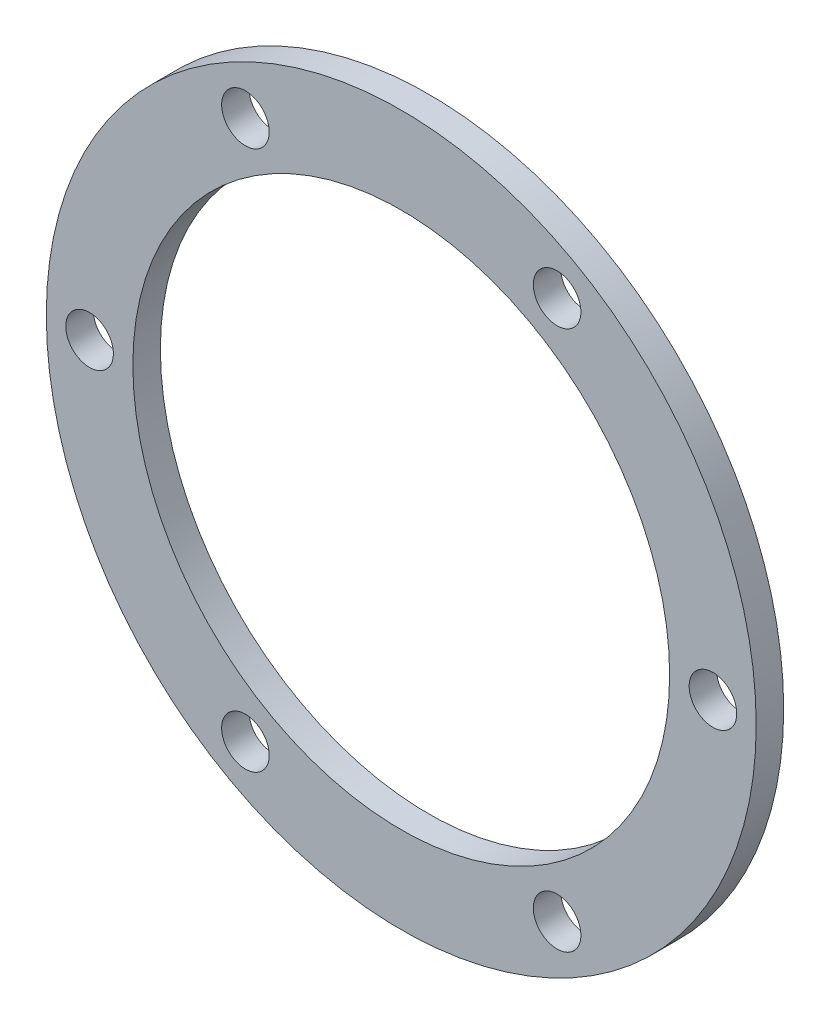
ISO-10303-21;
HEADER;
FILE_DESCRIPTION(('STEP AP214'),'2;1');
FILE_NAME('part.step','',(''),(''),'','','');
FILE_SCHEMA(('AUTOMOTIVE_DESIGN { 1 0 10303 214 1 1 1 1 }'));
ENDSEC;
DATA;
#1=APPLICATION_CONTEXT('core data for automotive mechanical design processes');
#2=APPLICATION_PROTOCOL_DEFINITION('international standard','automotive_design',2000,#1);
#3=PRODUCT_CONTEXT('',#1,'mechanical');
#4=PRODUCT('Part','Part','',(#3));
#5=PRODUCT_RELATED_PRODUCT_CATEGORY('part','',(#4));
#6=PRODUCT_DEFINITION_FORMATION('','',#4);
#7=PRODUCT_DEFINITION_CONTEXT('part definition',#1,'design');
#8=PRODUCT_DEFINITION('design','',#6,#7);
#9=PRODUCT_DEFINITION_SHAPE('','',#8);
#10=(LENGTH_UNIT() NAMED_UNIT(*) SI_UNIT(.MILLI.,.METRE.));
#11=(NAMED_UNIT(*) PLANE_ANGLE_UNIT() SI_UNIT($,.RADIAN.));
#12=(NAMED_UNIT(*) SI_UNIT($,.STERADIAN.) SOLID_ANGLE_UNIT());
#13=UNCERTAINTY_MEASURE_WITH_UNIT(LENGTH_MEASURE(1.E-05),#10,'distance_accuracy_value','');
#14=(GEOMETRIC_REPRESENTATION_CONTEXT(3) GLOBAL_UNCERTAINTY_ASSIGNED_CONTEXT((#13)) GLOBAL_UNIT_ASSIGNED_CONTEXT((#10,
#11,#12)) REPRESENTATION_CONTEXT('',''));
#15=CARTESIAN_POINT('',(0.,0.,0.));
#16=DIRECTION('',(0.,0.,1.));
#17=DIRECTION('',(1.,0.,0.));
#18=AXIS2_PLACEMENT_3D('',#15,#16,#17);
#19=CARTESIAN_POINT('',(0.,0.,3.175));
#20=DIRECTION('',(0.,0.,1.));
#21=DIRECTION('',(1.,0.,0.));
#22=AXIS2_PLACEMENT_3D('',#19,#20,#21);
#23=PLANE('',#22);
#24=CARTESIAN_POINT('',(-35.9999999999979,-1.28307327076601E-12,3.175));
#25=DIRECTION('',(0.,0.,1.));
#26=DIRECTION('',(1.,0.,0.));
#27=AXIS2_PLACEMENT_3D('',#24,#25,#26);
#28=CIRCLE('',#27,2.75);
#29=CARTESIAN_POINT('',(-33.2499999999979,-1.28307327076601E-12,3.175));
#30=VERTEX_POINT('',#29);
#31=EDGE_CURVE('E80',#30,#30,#28,.T.);
#32=ORIENTED_EDGE('',*,*,#31,.F.);
#33=EDGE_LOOP('',(#32));
#34=FACE_BOUND('',#33,.T.);
#35=CARTESIAN_POINT('',(-17.9999999999958,-31.1769145362398,3.175));
#36=DIRECTION('',(0.,0.,1.));
#37=DIRECTION('',(1.,0.,0.));
#38=AXIS2_PLACEMENT_3D('',#35,#36,#37);
#39=CIRCLE('',#38,2.75);
#40=CARTESIAN_POINT('',(-15.2499999999958,-31.1769145362398,3.175));
#41=VERTEX_POINT('',#40);
#42=EDGE_CURVE('E74',#41,#41,#39,.T.);
#43=ORIENTED_EDGE('',*,*,#42,.F.);
#44=EDGE_LOOP('',(#43));
#45=FACE_BOUND('',#44,.T.);
#46=CARTESIAN_POINT('',(18.0000000000042,-31.1769145362374,3.175));
#47=DIRECTION('',(0.,0.,1.));
#48=DIRECTION('',(1.,0.,0.));
#49=AXIS2_PLACEMENT_3D('',#46,#47,#48);
#50=CIRCLE('',#49,2.74999999999999);
#51=CARTESIAN_POINT('',(20.7500000000042,-31.1769145362374,3.175));
#52=VERTEX_POINT('',#51);
#53=EDGE_CURVE('E68',#52,#52,#50,.T.);
#54=ORIENTED_EDGE('',*,*,#53,.F.);
#55=EDGE_LOOP('',(#54));
#56=FACE_BOUND('',#55,.T.);
#57=CARTESIAN_POINT('',(36.0000000000021,3.64735229072368E-12,3.175));
#58=DIRECTION('',(0.,0.,1.));
#59=DIRECTION('',(1.,0.,0.));
#60=AXIS2_PLACEMENT_3D('',#57,#58,#59);
#61=CIRCLE('',#60,2.75000000000001);
#62=CARTESIAN_POINT('',(38.7500000000021,3.64735229072368E-12,3.175));
#63=VERTEX_POINT('',#62);
#64=EDGE_CURVE('E62',#63,#63,#61,.T.);
#65=ORIENTED_EDGE('',*,*,#64,.F.);
#66=EDGE_LOOP('',(#65));
#67=FACE_BOUND('',#66,.T.);
#68=CARTESIAN_POINT('',(18.,31.1769145362422,3.175));
#69=DIRECTION('',(0.,0.,1.));
#70=DIRECTION('',(1.,0.,0.));
#71=AXIS2_PLACEMENT_3D('',#68,#69,#70);
#72=CIRCLE('',#71,2.74999999999999);
#73=CARTESIAN_POINT('',(20.7499999999999,31.1769145362422,3.175));
#74=VERTEX_POINT('',#73);
#75=EDGE_CURVE('E56',#74,#74,#72,.T.);
#76=ORIENTED_EDGE('',*,*,#75,.F.);
#77=EDGE_LOOP('',(#76));
#78=FACE_BOUND('',#77,.T.);
#79=CARTESIAN_POINT('',(-18.,31.1769145362398,3.175));
#80=DIRECTION('',(0.,0.,1.));
#81=DIRECTION('',(1.,0.,0.));
#82=AXIS2_PLACEMENT_3D('',#79,#80,#81);
#83=CIRCLE('',#82,2.75);
#84=CARTESIAN_POINT('',(-15.25,31.1769145362398,3.175));
#85=VERTEX_POINT('',#84);
#86=EDGE_CURVE('E50',#85,#85,#83,.T.);
#87=ORIENTED_EDGE('',*,*,#86,.F.);
#88=EDGE_LOOP('',(#87));
#89=FACE_BOUND('',#88,.T.);
#90=CARTESIAN_POINT('',(0.,0.,3.175));
#91=DIRECTION('',(0.,0.,1.));
#92=DIRECTION('',(1.,0.,0.));
#93=AXIS2_PLACEMENT_3D('',#90,#91,#92);
#94=CIRCLE('',#93,41.);
#95=CARTESIAN_POINT('',(41.,0.,3.175));
#96=VERTEX_POINT('',#95);
#97=EDGE_CURVE('E10',#96,#96,#94,.T.);
#98=ORIENTED_EDGE('',*,*,#97,.T.);
#99=EDGE_LOOP('',(#98));
#100=FACE_BOUND('',#99,.T.);
#101=CARTESIAN_POINT('',(0.,0.,3.175));
#102=DIRECTION('',(0.,0.,1.));
#103=DIRECTION('',(1.,0.,0.));
#104=AXIS2_PLACEMENT_3D('',#101,#102,#103);
#105=CIRCLE('',#104,31.);
#106=CARTESIAN_POINT('',(31.,0.,3.175));
#107=VERTEX_POINT('',#106);
#108=EDGE_CURVE('E42',#107,#107,#105,.T.);
#109=ORIENTED_EDGE('',*,*,#108,.F.);
#110=EDGE_LOOP('',(#109));
#111=FACE_BOUND('',#110,.T.);
#112=ADVANCED_FACE('F31',(#34,#45,#56,#67,#78,#89,#100,#111),#23,.T.);
#113=CARTESIAN_POINT('',(0.,0.,0.));
#114=DIRECTION('',(0.,0.,1.));
#115=DIRECTION('',(1.,0.,0.));
#116=AXIS2_PLACEMENT_3D('',#113,#114,#115);
#117=PLANE('',#116);
#118=CARTESIAN_POINT('',(-35.9999999999979,-1.28307327076601E-12,0.));
#119=DIRECTION('',(0.,0.,1.));
#120=DIRECTION('',(1.,0.,0.));
#121=AXIS2_PLACEMENT_3D('',#118,#119,#120);
#122=CIRCLE('',#121,2.75);
#123=CARTESIAN_POINT('',(-33.2499999999979,-1.28307327076601E-12,0.));
#124=VERTEX_POINT('',#123);
#125=EDGE_CURVE('E77',#124,#124,#122,.T.);
#126=ORIENTED_EDGE('',*,*,#125,.T.);
#127=EDGE_LOOP('',(#126));
#128=FACE_BOUND('',#127,.T.);
#129=CARTESIAN_POINT('',(-17.9999999999958,-31.1769145362398,0.));
#130=DIRECTION('',(0.,0.,1.));
#131=DIRECTION('',(1.,0.,0.));
#132=AXIS2_PLACEMENT_3D('',#129,#130,#131);
#133=CIRCLE('',#132,2.75);
#134=CARTESIAN_POINT('',(-15.2499999999958,-31.1769145362398,0.));
#135=VERTEX_POINT('',#134);
#136=EDGE_CURVE('E71',#135,#135,#133,.T.);
#137=ORIENTED_EDGE('',*,*,#136,.T.);
#138=EDGE_LOOP('',(#137));
#139=FACE_BOUND('',#138,.T.);
#140=CARTESIAN_POINT('',(18.0000000000042,-31.1769145362374,0.));
#141=DIRECTION('',(0.,0.,1.));
#142=DIRECTION('',(1.,0.,0.));
#143=AXIS2_PLACEMENT_3D('',#140,#141,#142);
#144=CIRCLE('',#143,2.74999999999999);
#145=CARTESIAN_POINT('',(20.7500000000042,-31.1769145362374,0.));
#146=VERTEX_POINT('',#145);
#147=EDGE_CURVE('E65',#146,#146,#144,.T.);
#148=ORIENTED_EDGE('',*,*,#147,.T.);
#149=EDGE_LOOP('',(#148));
#150=FACE_BOUND('',#149,.T.);
#151=CARTESIAN_POINT('',(36.0000000000021,3.64735229072368E-12,0.));
#152=DIRECTION('',(0.,0.,1.));
#153=DIRECTION('',(1.,0.,0.));
#154=AXIS2_PLACEMENT_3D('',#151,#152,#153);
#155=CIRCLE('',#154,2.75000000000001);
#156=CARTESIAN_POINT('',(38.7500000000021,3.64735229072368E-12,0.));
#157=VERTEX_POINT('',#156);
#158=EDGE_CURVE('E59',#157,#157,#155,.T.);
#159=ORIENTED_EDGE('',*,*,#158,.T.);
#160=EDGE_LOOP('',(#159));
#161=FACE_BOUND('',#160,.T.);
#162=CARTESIAN_POINT('',(18.,31.1769145362422,0.));
#163=DIRECTION('',(0.,0.,1.));
#164=DIRECTION('',(1.,0.,0.));
#165=AXIS2_PLACEMENT_3D('',#162,#163,#164);
#166=CIRCLE('',#165,2.74999999999999);
#167=CARTESIAN_POINT('',(20.7499999999999,31.1769145362422,0.));
#168=VERTEX_POINT('',#167);
#169=EDGE_CURVE('E53',#168,#168,#166,.T.);
#170=ORIENTED_EDGE('',*,*,#169,.T.);
#171=EDGE_LOOP('',(#170));
#172=FACE_BOUND('',#171,.T.);
#173=CARTESIAN_POINT('',(-18.,31.1769145362398,0.));
#174=DIRECTION('',(0.,0.,1.));
#175=DIRECTION('',(1.,0.,0.));
#176=AXIS2_PLACEMENT_3D('',#173,#174,#175);
#177=CIRCLE('',#176,2.75);
#178=CARTESIAN_POINT('',(-15.25,31.1769145362398,0.));
#179=VERTEX_POINT('',#178);
#180=EDGE_CURVE('E47',#179,#179,#177,.T.);
#181=ORIENTED_EDGE('',*,*,#180,.T.);
#182=EDGE_LOOP('',(#181));
#183=FACE_BOUND('',#182,.T.);
#184=CARTESIAN_POINT('',(0.,0.,0.));
#185=DIRECTION('',(0.,0.,1.));
#186=DIRECTION('',(1.,0.,0.));
#187=AXIS2_PLACEMENT_3D('',#184,#185,#186);
#188=CIRCLE('',#187,41.);
#189=CARTESIAN_POINT('',(41.,0.,0.));
#190=VERTEX_POINT('',#189);
#191=EDGE_CURVE('E35',#190,#190,#188,.T.);
#192=ORIENTED_EDGE('',*,*,#191,.F.);
#193=EDGE_LOOP('',(#192));
#194=FACE_BOUND('',#193,.T.);
#195=CARTESIAN_POINT('',(0.,0.,0.));
#196=DIRECTION('',(0.,0.,1.));
#197=DIRECTION('',(1.,0.,0.));
#198=AXIS2_PLACEMENT_3D('',#195,#196,#197);
#199=CIRCLE('',#198,31.);
#200=CARTESIAN_POINT('',(31.,0.,0.));
#201=VERTEX_POINT('',#200);
#202=EDGE_CURVE('E44',#201,#201,#199,.T.);
#203=ORIENTED_EDGE('',*,*,#202,.T.);
#204=EDGE_LOOP('',(#203));
#205=FACE_BOUND('',#204,.T.);
#206=ADVANCED_FACE('F86',(#128,#139,#150,#161,#172,#183,#194,#205),#117,.F.);
#207=CARTESIAN_POINT('',(0.,0.,3.175));
#208=DIRECTION('',(0.,0.,-1.));
#209=DIRECTION('',(-1.,0.,0.));
#210=AXIS2_PLACEMENT_3D('',#207,#208,#209);
#211=CYLINDRICAL_SURFACE('',#210,41.);
#212=ORIENTED_EDGE('',*,*,#97,.F.);
#213=EDGE_LOOP('',(#212));
#214=FACE_BOUND('',#213,.T.);
#215=ORIENTED_EDGE('',*,*,#191,.T.);
#216=EDGE_LOOP('',(#215));
#217=FACE_BOUND('',#216,.T.);
#218=ADVANCED_FACE('F33',(#214,#217),#211,.T.);
#219=CARTESIAN_POINT('',(0.,0.,3.175));
#220=DIRECTION('',(0.,0.,-1.));
#221=DIRECTION('',(-1.,0.,0.));
#222=AXIS2_PLACEMENT_3D('',#219,#220,#221);
#223=CYLINDRICAL_SURFACE('',#222,31.);
#224=ORIENTED_EDGE('',*,*,#108,.T.);
#225=EDGE_LOOP('',(#224));
#226=FACE_BOUND('',#225,.T.);
#227=ORIENTED_EDGE('',*,*,#202,.F.);
#228=EDGE_LOOP('',(#227));
#229=FACE_BOUND('',#228,.T.);
#230=ADVANCED_FACE('F111',(#226,#229),#223,.F.);
#231=CARTESIAN_POINT('',(-18.,31.1769145362398,0.));
#232=DIRECTION('',(0.,0.,1.));
#233=DIRECTION('',(1.,0.,0.));
#234=AXIS2_PLACEMENT_3D('',#231,#232,#233);
#235=CYLINDRICAL_SURFACE('',#234,2.75);
#236=ORIENTED_EDGE('',*,*,#180,.F.);
#237=EDGE_LOOP('',(#236));
#238=FACE_BOUND('',#237,.T.);
#239=ORIENTED_EDGE('',*,*,#86,.T.);
#240=EDGE_LOOP('',(#239));
#241=FACE_BOUND('',#240,.T.);
#242=ADVANCED_FACE('F114',(#238,#241),#235,.F.);
#243=CARTESIAN_POINT('',(18.,31.1769145362422,0.));
#244=DIRECTION('',(0.,0.,1.));
#245=DIRECTION('',(1.,0.,0.));
#246=AXIS2_PLACEMENT_3D('',#243,#244,#245);
#247=CYLINDRICAL_SURFACE('',#246,2.74999999999999);
#248=ORIENTED_EDGE('',*,*,#169,.F.);
#249=EDGE_LOOP('',(#248));
#250=FACE_BOUND('',#249,.T.);
#251=ORIENTED_EDGE('',*,*,#75,.T.);
#252=EDGE_LOOP('',(#251));
#253=FACE_BOUND('',#252,.T.);
#254=ADVANCED_FACE('F126',(#250,#253),#247,.F.);
#255=CARTESIAN_POINT('',(36.0000000000021,3.64735229072368E-12,0.));
#256=DIRECTION('',(0.,0.,1.));
#257=DIRECTION('',(1.,0.,0.));
#258=AXIS2_PLACEMENT_3D('',#255,#256,#257);
#259=CYLINDRICAL_SURFACE('',#258,2.75000000000001);
#260=ORIENTED_EDGE('',*,*,#158,.F.);
#261=EDGE_LOOP('',(#260));
#262=FACE_BOUND('',#261,.T.);
#263=ORIENTED_EDGE('',*,*,#64,.T.);
#264=EDGE_LOOP('',(#263));
#265=FACE_BOUND('',#264,.T.);
#266=ADVANCED_FACE('F130',(#262,#265),#259,.F.);
#267=CARTESIAN_POINT('',(18.0000000000042,-31.1769145362374,0.));
#268=DIRECTION('',(0.,0.,1.));
#269=DIRECTION('',(1.,0.,0.));
#270=AXIS2_PLACEMENT_3D('',#267,#268,#269);
#271=CYLINDRICAL_SURFACE('',#270,2.74999999999999);
#272=ORIENTED_EDGE('',*,*,#147,.F.);
#273=EDGE_LOOP('',(#272));
#274=FACE_BOUND('',#273,.T.);
#275=ORIENTED_EDGE('',*,*,#53,.T.);
#276=EDGE_LOOP('',(#275));
#277=FACE_BOUND('',#276,.T.);
#278=ADVANCED_FACE('F134',(#274,#277),#271,.F.);
#279=CARTESIAN_POINT('',(-17.9999999999958,-31.1769145362398,0.));
#280=DIRECTION('',(0.,0.,1.));
#281=DIRECTION('',(1.,0.,0.));
#282=AXIS2_PLACEMENT_3D('',#279,#280,#281);
#283=CYLINDRICAL_SURFACE('',#282,2.75);
#284=ORIENTED_EDGE('',*,*,#136,.F.);
#285=EDGE_LOOP('',(#284));
#286=FACE_BOUND('',#285,.T.);
#287=ORIENTED_EDGE('',*,*,#42,.T.);
#288=EDGE_LOOP('',(#287));
#289=FACE_BOUND('',#288,.T.);
#290=ADVANCED_FACE('F92',(#286,#289),#283,.F.);
#291=CARTESIAN_POINT('',(-35.9999999999979,-1.28307327076601E-12,0.));
#292=DIRECTION('',(0.,0.,1.));
#293=DIRECTION('',(1.,0.,0.));
#294=AXIS2_PLACEMENT_3D('',#291,#292,#293);
#295=CYLINDRICAL_SURFACE('',#294,2.75);
#296=ORIENTED_EDGE('',*,*,#125,.F.);
#297=EDGE_LOOP('',(#296));
#298=FACE_BOUND('',#297,.T.);
#299=ORIENTED_EDGE('',*,*,#31,.T.);
#300=EDGE_LOOP('',(#299));
#301=FACE_BOUND('',#300,.T.);
#302=ADVANCED_FACE('F89',(#298,#301),#295,.F.);
#303=CLOSED_SHELL('',(#112,#206,#218,#230,#242,#254,#266,#278,#290,#302));
#304=MANIFOLD_SOLID_BREP('B2',#303);
#305=ADVANCED_BREP_SHAPE_REPRESENTATION('',(#18,#304),#14);
#306=SHAPE_DEFINITION_REPRESENTATION(#9,#305);
ENDSEC;
END-ISO-10303-21;
